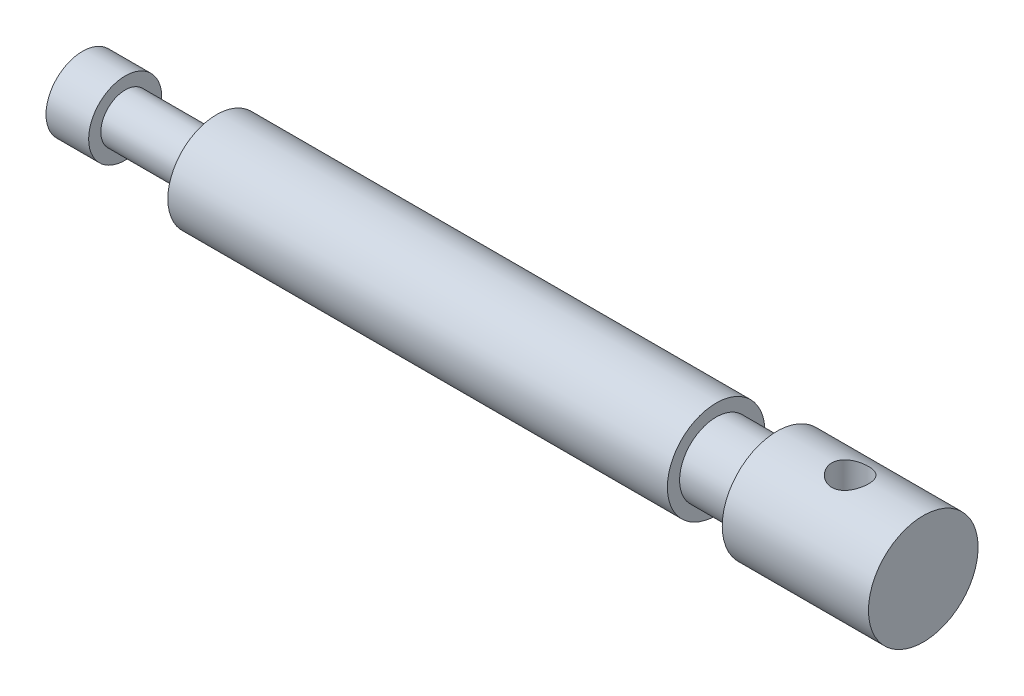
ISO-10303-21;
HEADER;
FILE_DESCRIPTION(('STEP AP214'),'2;1');
FILE_NAME('part.step','',(''),(''),'','','');
FILE_SCHEMA(('AUTOMOTIVE_DESIGN { 1 0 10303 214 1 1 1 1 }'));
ENDSEC;
DATA;
#1=APPLICATION_CONTEXT('core data for automotive mechanical design processes');
#2=APPLICATION_PROTOCOL_DEFINITION('international standard','automotive_design',2000,#1);
#3=PRODUCT_CONTEXT('',#1,'mechanical');
#4=PRODUCT('Part','Part','',(#3));
#5=PRODUCT_RELATED_PRODUCT_CATEGORY('part','',(#4));
#6=PRODUCT_DEFINITION_FORMATION('','',#4);
#7=PRODUCT_DEFINITION_CONTEXT('part definition',#1,'design');
#8=PRODUCT_DEFINITION('design','',#6,#7);
#9=PRODUCT_DEFINITION_SHAPE('','',#8);
#10=(LENGTH_UNIT() NAMED_UNIT(*) SI_UNIT(.MILLI.,.METRE.));
#11=(NAMED_UNIT(*) PLANE_ANGLE_UNIT() SI_UNIT($,.RADIAN.));
#12=(NAMED_UNIT(*) SI_UNIT($,.STERADIAN.) SOLID_ANGLE_UNIT());
#13=UNCERTAINTY_MEASURE_WITH_UNIT(LENGTH_MEASURE(1.E-05),#10,'distance_accuracy_value','');
#14=(GEOMETRIC_REPRESENTATION_CONTEXT(3) GLOBAL_UNCERTAINTY_ASSIGNED_CONTEXT((#13)) GLOBAL_UNIT_ASSIGNED_CONTEXT((#10,
#11,#12)) REPRESENTATION_CONTEXT('',''));
#15=CARTESIAN_POINT('',(0.,0.,0.));
#16=DIRECTION('',(0.,0.,1.));
#17=DIRECTION('',(1.,0.,0.));
#18=AXIS2_PLACEMENT_3D('',#15,#16,#17);
#19=CARTESIAN_POINT('',(0.,0.,0.));
#20=DIRECTION('',(-1.,0.,0.));
#21=DIRECTION('',(0.,0.,1.));
#22=AXIS2_PLACEMENT_3D('',#19,#20,#21);
#23=CYLINDRICAL_SURFACE('',#22,9.);
#24=CARTESIAN_POINT('',(126.,-8.48528137423857,-2.99999999999999));
#25=CARTESIAN_POINT('',(125.836595475492,-8.48528083591302,-3.00000077384313));
#26=CARTESIAN_POINT('',(125.673195600529,-8.49005307872572,-2.98660435105656));
#27=CARTESIAN_POINT('',(125.351236737017,-8.50852722243765,-2.93355339506642));
#28=CARTESIAN_POINT('',(125.192678550383,-8.52223059426566,-2.89389453650519));
#29=CARTESIAN_POINT('',(124.885119321008,-8.55684611066375,-2.78986645705471));
#30=CARTESIAN_POINT('',(124.736100211672,-8.57774411913966,-2.72554566420974));
#31=CARTESIAN_POINT('',(124.450919854356,-8.62437366030974,-2.57418488532414));
#32=CARTESIAN_POINT('',(124.314761452339,-8.65010625910837,-2.48713988658055));
#33=CARTESIAN_POINT('',(124.053840112985,-8.70463468222419,-2.28915343932863));
#34=CARTESIAN_POINT('',(123.929653713985,-8.73350684533932,-2.17747302413376));
#35=CARTESIAN_POINT('',(123.701379596326,-8.79041594403009,-1.93496300164319));
#36=CARTESIAN_POINT('',(123.597295105253,-8.81845274486885,-1.80413032515714));
#37=CARTESIAN_POINT('',(123.409563308011,-8.87141600765396,-1.52281352389504));
#38=CARTESIAN_POINT('',(123.326520088146,-8.89624223104816,-1.37190573367359));
#39=CARTESIAN_POINT('',(123.187225244617,-8.93908760312949,-1.05729366896244));
#40=CARTESIAN_POINT('',(123.130966400469,-8.95710858609006,-0.893592857061653));
#41=CARTESIAN_POINT('',(123.048792436103,-8.9837722629572,-0.564086452300499));
#42=CARTESIAN_POINT('',(123.021889661229,-8.99271944332677,-0.398552264558921));
#43=CARTESIAN_POINT('',(122.996051119918,-9.00130824654744,-0.0650936244722837));
#44=CARTESIAN_POINT('',(122.997108145043,-9.00095226788686,0.102830200631674));
#45=CARTESIAN_POINT('',(123.026532763698,-8.99118118856194,0.42931054558143));
#46=CARTESIAN_POINT('',(123.053827585423,-8.98212194265352,0.587976145774955));
#47=CARTESIAN_POINT('',(123.133178942941,-8.95640902019195,0.8983303164665));
#48=CARTESIAN_POINT('',(123.185237156939,-8.93975482893545,1.05001841333763));
#49=CARTESIAN_POINT('',(123.313263951918,-8.90027010879673,1.3444574245259));
#50=CARTESIAN_POINT('',(123.38953781564,-8.87736127572047,1.48706466290652));
#51=CARTESIAN_POINT('',(123.563579116346,-8.82775179116758,1.75777297658195));
#52=CARTESIAN_POINT('',(123.661352529983,-8.80105008604401,1.88587000315601));
#53=CARTESIAN_POINT('',(123.881023180379,-8.7451857554969,2.13030259965391));
#54=CARTESIAN_POINT('',(124.003839473524,-8.71596645506633,2.2458004711958));
#55=CARTESIAN_POINT('',(124.26734617718,-8.65942005746702,2.45483177879451));
#56=CARTESIAN_POINT('',(124.408039337184,-8.63209325236847,2.54836182984462));
#57=CARTESIAN_POINT('',(124.70596087681,-8.58211575363337,2.71196236510722));
#58=CARTESIAN_POINT('',(124.863396393953,-8.55953727854244,2.78167939086401));
#59=CARTESIAN_POINT('',(125.188714182643,-8.52244952473155,2.893329579808));
#60=CARTESIAN_POINT('',(125.356592043619,-8.50793686461278,2.93527438724248));
#61=CARTESIAN_POINT('',(125.689915066235,-8.48938908946755,2.98848384629256));
#62=CARTESIAN_POINT('',(125.855128274246,-8.48491080956268,3.00104728652289));
#63=CARTESIAN_POINT('',(126.185328447342,-8.48570016177553,2.99881631672915));
#64=CARTESIAN_POINT('',(126.350315448072,-8.49096602375444,2.98402687568028));
#65=CARTESIAN_POINT('',(126.669470897136,-8.51020854270898,2.92867695465693));
#66=CARTESIAN_POINT('',(126.823816290452,-8.52387976322521,2.88901918194205));
#67=CARTESIAN_POINT('',(127.123630818718,-8.55805661013069,2.7861415876814));
#68=CARTESIAN_POINT('',(127.269098374772,-8.57856344804518,2.72291758909027));
#69=CARTESIAN_POINT('',(127.552141262541,-8.6249063278736,2.57242302221682));
#70=CARTESIAN_POINT('',(127.689319927925,-8.65089076996884,2.48445335507551));
#71=CARTESIAN_POINT('',(127.947438157151,-8.70497306192896,2.28775689167269));
#72=CARTESIAN_POINT('',(128.068372915984,-8.73307153331383,2.17902397649636));
#73=CARTESIAN_POINT('',(128.296583952272,-8.78985115913547,1.93767511770099));
#74=CARTESIAN_POINT('',(128.402923170057,-8.81849530733689,1.80416181163997));
#75=CARTESIAN_POINT('',(128.591748427044,-8.87180554839326,1.52048187420078));
#76=CARTESIAN_POINT('',(128.674235313487,-8.89647178253084,1.37031583459367));
#77=CARTESIAN_POINT('',(128.812260314585,-8.93893217431809,1.0583395872969));
#78=CARTESIAN_POINT('',(128.867973831444,-8.95677090013593,0.896613369963606));
#79=CARTESIAN_POINT('',(128.95118322618,-8.98375832513324,0.565375397538069));
#80=CARTESIAN_POINT('',(128.978689289642,-8.99291016102056,0.395866475861687));
#81=CARTESIAN_POINT('',(129.003786232817,-9.00125589708769,0.0624460075801409));
#82=CARTESIAN_POINT('',(129.002722361797,-9.00089760268318,-0.101354171760038));
#83=CARTESIAN_POINT('',(128.974028075561,-8.99136589558194,-0.426333435000507));
#84=CARTESIAN_POINT('',(128.946399815542,-8.98219319800727,-0.587512730457158));
#85=CARTESIAN_POINT('',(128.866253296272,-8.95622744863237,-0.900126358296163));
#86=CARTESIAN_POINT('',(128.814137353941,-8.93955775083446,-1.05167481273835));
#87=CARTESIAN_POINT('',(128.686867406709,-8.90031482113486,-1.34393505281937));
#88=CARTESIAN_POINT('',(128.611709234409,-8.8777405214405,-1.48464487242728));
#89=CARTESIAN_POINT('',(128.437291463694,-8.82797606483643,-1.75690204892635));
#90=CARTESIAN_POINT('',(128.337243943855,-8.8006461747578,-1.88791875467282));
#91=CARTESIAN_POINT('',(128.117227826531,-8.74478966375639,-2.13174307881727));
#92=CARTESIAN_POINT('',(127.997252873212,-8.71626266319292,-2.24454486487376));
#93=CARTESIAN_POINT('',(127.735171933239,-8.65989839476795,-2.45322542649934));
#94=CARTESIAN_POINT('',(127.59238346707,-8.63213183965892,-2.54826889799369));
#95=CARTESIAN_POINT('',(127.291996719292,-8.58180579969046,-2.71294302990334));
#96=CARTESIAN_POINT('',(127.134402320911,-8.55924495483748,-2.78258033045842));
#97=CARTESIAN_POINT('',(126.816114527953,-8.52304002619544,-2.89153148461249));
#98=CARTESIAN_POINT('',(126.655883209424,-8.50903898571547,-2.93207372744855));
#99=CARTESIAN_POINT('',(126.3304318486,-8.49016150618555,-2.9863029604478));
#100=CARTESIAN_POINT('',(126.165213547768,-8.48528191852384,-2.99999921758977));
#101=CARTESIAN_POINT('',(126.,-8.48528137423857,-2.99999999999999));
#102=B_SPLINE_CURVE_WITH_KNOTS('',3,(#24,#25,#26,#27,#28,#29,#30,#31,#32,#33,#34,#35,#36,#37,
#38,#39,#40,#41,#42,#43,#44,#45,#46,#47,#48,#49,#50,#51,#52,#53,#54,#55,#56,#57,#58,#59,#60,#61,
#62,#63,#64,#65,#66,#67,#68,#69,#70,#71,#72,#73,#74,#75,#76,#77,#78,#79,#80,#81,#82,#83,#84,#85,
#86,#87,#88,#89,#90,#91,#92,#93,#94,#95,#96,#97,#98,#99,#100,#101),.UNSPECIFIED.,.T.,.F.,(4,2,2,
2,2,2,2,2,2,2,2,2,2,2,2,2,2,2,2,2,2,2,2,2,2,2,2,2,2,2,2,2,2,2,2,2,2,2,4),(0.,0.489601754398035,
0.979284165045477,1.46800988250247,1.95684349855631,2.46304012282703,2.96931795515961,
3.48880518430968,4.00815229160365,4.509429562948,5.01057759906979,5.49207014476705,
5.97359532567707,6.46144964581001,6.94943975622063,7.46040523091749,7.97144938836314,
8.48977919529162,9.00789154069845,9.50262874093315,9.99727607511698,10.4749318730632,
10.9526723744083,11.4455657320714,11.9386045698638,12.4553642451328,12.9721055627259,
13.4854137357255,13.9985364901247,14.487542540329,14.9765089202934,15.4577086812129,
15.9389955228972,16.438065585619,16.9372951329789,17.4560670820843,17.974703348006,
18.4698963648807,18.9649184157139),.UNSPECIFIED.);
#103=CARTESIAN_POINT('',(126.,-8.48528137423857,-2.99999999999999));
#104=VERTEX_POINT('',#103);
#105=EDGE_CURVE('E64',#104,#104,#102,.T.);
#106=ORIENTED_EDGE('',*,*,#105,.T.);
#107=EDGE_LOOP('',(#106));
#108=FACE_BOUND('',#107,.T.);
#109=CARTESIAN_POINT('',(138.,0.,0.));
#110=DIRECTION('',(-1.,0.,0.));
#111=DIRECTION('',(0.,0.,1.));
#112=AXIS2_PLACEMENT_3D('',#109,#110,#111);
#113=CIRCLE('',#112,9.);
#114=CARTESIAN_POINT('',(138.,0.,9.));
#115=VERTEX_POINT('',#114);
#116=EDGE_CURVE('E10',#115,#115,#113,.T.);
#117=ORIENTED_EDGE('',*,*,#116,.T.);
#118=EDGE_LOOP('',(#117));
#119=FACE_BOUND('',#118,.T.);
#120=CARTESIAN_POINT('',(114.,0.,0.));
#121=DIRECTION('',(-1.,0.,0.));
#122=DIRECTION('',(0.,0.,1.));
#123=AXIS2_PLACEMENT_3D('',#120,#121,#122);
#124=CIRCLE('',#123,9.);
#125=CARTESIAN_POINT('',(114.,0.,9.));
#126=VERTEX_POINT('',#125);
#127=EDGE_CURVE('E55',#126,#126,#124,.T.);
#128=ORIENTED_EDGE('',*,*,#127,.F.);
#129=EDGE_LOOP('',(#128));
#130=FACE_BOUND('',#129,.T.);
#131=CARTESIAN_POINT('',(126.,8.48528137423857,-2.99999999999999));
#132=CARTESIAN_POINT('',(126.163404524508,8.48528083591302,-3.00000077384313));
#133=CARTESIAN_POINT('',(126.326804399471,8.49005307872572,-2.98660435105656));
#134=CARTESIAN_POINT('',(126.648763262983,8.50852722243765,-2.93355339506642));
#135=CARTESIAN_POINT('',(126.807321449617,8.52223059426566,-2.89389453650519));
#136=CARTESIAN_POINT('',(127.114880678992,8.55684611066375,-2.78986645705471));
#137=CARTESIAN_POINT('',(127.263899788328,8.57774411913966,-2.72554566420974));
#138=CARTESIAN_POINT('',(127.549080145644,8.62437366030974,-2.57418488532414));
#139=CARTESIAN_POINT('',(127.685238547661,8.65010625910837,-2.48713988658055));
#140=CARTESIAN_POINT('',(127.946159887015,8.70463468222419,-2.28915343932863));
#141=CARTESIAN_POINT('',(128.070346286015,8.73350684533932,-2.17747302413376));
#142=CARTESIAN_POINT('',(128.298620403674,8.79041594403009,-1.93496300164319));
#143=CARTESIAN_POINT('',(128.402704894747,8.81845274486885,-1.80413032515713));
#144=CARTESIAN_POINT('',(128.590436691989,8.87141600765397,-1.52281352389503));
#145=CARTESIAN_POINT('',(128.673479911854,8.89624223104817,-1.37190573367358));
#146=CARTESIAN_POINT('',(128.812774755383,8.93908760312949,-1.05729366896243));
#147=CARTESIAN_POINT('',(128.869033599531,8.95710858609006,-0.893592857061646));
#148=CARTESIAN_POINT('',(128.951207563897,8.9837722629572,-0.564086452300496));
#149=CARTESIAN_POINT('',(128.978110338771,8.99271944332677,-0.398552264558917));
#150=CARTESIAN_POINT('',(129.003948880082,9.00130824654744,-0.0650936244722798));
#151=CARTESIAN_POINT('',(129.002891854957,9.00095226788686,0.102830200631678));
#152=CARTESIAN_POINT('',(128.973467236302,8.99118118856194,0.429310545581434));
#153=CARTESIAN_POINT('',(128.946172414577,8.98212194265352,0.587976145774959));
#154=CARTESIAN_POINT('',(128.866821057059,8.95640902019195,0.898330316466505));
#155=CARTESIAN_POINT('',(128.814762843061,8.93975482893545,1.05001841333764));
#156=CARTESIAN_POINT('',(128.686736048082,8.90027010879673,1.3444574245259));
#157=CARTESIAN_POINT('',(128.61046218436,8.87736127572047,1.48706466290652));
#158=CARTESIAN_POINT('',(128.436420883654,8.82775179116758,1.75777297658195));
#159=CARTESIAN_POINT('',(128.338647470017,8.80105008604401,1.88587000315601));
#160=CARTESIAN_POINT('',(128.118976819621,8.7451857554969,2.13030259965391));
#161=CARTESIAN_POINT('',(127.996160526476,8.71596645506633,2.24580047119581));
#162=CARTESIAN_POINT('',(127.73265382282,8.65942005746702,2.45483177879452));
#163=CARTESIAN_POINT('',(127.591960662816,8.63209325236846,2.54836182984462));
#164=CARTESIAN_POINT('',(127.29403912319,8.58211575363337,2.71196236510722));
#165=CARTESIAN_POINT('',(127.136603606047,8.55953727854244,2.78167939086401));
#166=CARTESIAN_POINT('',(126.811285817357,8.52244952473155,2.893329579808));
#167=CARTESIAN_POINT('',(126.643407956381,8.50793686461278,2.93527438724248));
#168=CARTESIAN_POINT('',(126.310084933765,8.48938908946755,2.98848384629256));
#169=CARTESIAN_POINT('',(126.144871725754,8.48491080956268,3.00104728652289));
#170=CARTESIAN_POINT('',(125.814671552658,8.48570016177553,2.99881631672915));
#171=CARTESIAN_POINT('',(125.649684551928,8.49096602375444,2.98402687568029));
#172=CARTESIAN_POINT('',(125.330529102864,8.51020854270898,2.92867695465693));
#173=CARTESIAN_POINT('',(125.176183709548,8.52387976322521,2.88901918194205));
#174=CARTESIAN_POINT('',(124.876369181282,8.55805661013069,2.7861415876814));
#175=CARTESIAN_POINT('',(124.730901625228,8.57856344804518,2.72291758909027));
#176=CARTESIAN_POINT('',(124.447858737459,8.62490632787361,2.57242302221681));
#177=CARTESIAN_POINT('',(124.310680072075,8.65089076996885,2.48445335507549));
#178=CARTESIAN_POINT('',(124.052561842849,8.70497306192896,2.28775689167267));
#179=CARTESIAN_POINT('',(123.931627084016,8.73307153331383,2.17902397649635));
#180=CARTESIAN_POINT('',(123.703416047728,8.78985115913547,1.93767511770099));
#181=CARTESIAN_POINT('',(123.597076829943,8.81849530733689,1.80416181163997));
#182=CARTESIAN_POINT('',(123.408251572956,8.87180554839326,1.52048187420079));
#183=CARTESIAN_POINT('',(123.325764686513,8.89647178253084,1.37031583459367));
#184=CARTESIAN_POINT('',(123.187739685415,8.93893217431809,1.0583395872969));
#185=CARTESIAN_POINT('',(123.132026168556,8.95677090013593,0.896613369963602));
#186=CARTESIAN_POINT('',(123.04881677382,8.98375832513324,0.565375397538062));
#187=CARTESIAN_POINT('',(123.021310710359,8.99291016102056,0.395866475861682));
#188=CARTESIAN_POINT('',(122.996213767183,9.00125589708769,0.0624460075801372));
#189=CARTESIAN_POINT('',(122.997277638203,9.00089760268318,-0.101354171760041));
#190=CARTESIAN_POINT('',(123.025971924439,8.99136589558194,-0.426333435000507));
#191=CARTESIAN_POINT('',(123.053600184458,8.98219319800727,-0.587512730457156));
#192=CARTESIAN_POINT('',(123.133746703728,8.95622744863237,-0.900126358296162));
#193=CARTESIAN_POINT('',(123.185862646059,8.93955775083446,-1.05167481273835));
#194=CARTESIAN_POINT('',(123.313132593291,8.90031482113485,-1.34393505281937));
#195=CARTESIAN_POINT('',(123.388290765591,8.8777405214405,-1.48464487242728));
#196=CARTESIAN_POINT('',(123.562708536306,8.82797606483643,-1.75690204892634));
#197=CARTESIAN_POINT('',(123.662756056145,8.8006461747578,-1.88791875467281));
#198=CARTESIAN_POINT('',(123.882772173469,8.74478966375639,-2.13174307881726));
#199=CARTESIAN_POINT('',(124.002747126788,8.71626266319292,-2.24454486487376));
#200=CARTESIAN_POINT('',(124.264828066761,8.65989839476795,-2.45322542649934));
#201=CARTESIAN_POINT('',(124.40761653293,8.63213183965892,-2.54826889799369));
#202=CARTESIAN_POINT('',(124.708003280708,8.58180579969046,-2.71294302990333));
#203=CARTESIAN_POINT('',(124.865597679089,8.55924495483748,-2.78258033045841));
#204=CARTESIAN_POINT('',(125.183885472047,8.52304002619544,-2.89153148461249));
#205=CARTESIAN_POINT('',(125.344116790576,8.50903898571547,-2.93207372744855));
#206=CARTESIAN_POINT('',(125.6695681514,8.49016150618555,-2.9863029604478));
#207=CARTESIAN_POINT('',(125.834786452232,8.48528191852384,-2.99999921758977));
#208=CARTESIAN_POINT('',(126.,8.48528137423857,-2.99999999999999));
#209=B_SPLINE_CURVE_WITH_KNOTS('',3,(#131,#132,#133,#134,#135,#136,#137,#138,#139,#140,#141,
#142,#143,#144,#145,#146,#147,#148,#149,#150,#151,#152,#153,#154,#155,#156,#157,#158,#159,#160,
#161,#162,#163,#164,#165,#166,#167,#168,#169,#170,#171,#172,#173,#174,#175,#176,#177,#178,#179,
#180,#181,#182,#183,#184,#185,#186,#187,#188,#189,#190,#191,#192,#193,#194,#195,#196,#197,#198,
#199,#200,#201,#202,#203,#204,#205,#206,#207,#208),.UNSPECIFIED.,.T.,.F.,(4,2,2,2,2,2,2,2,2,2,2,
2,2,2,2,2,2,2,2,2,2,2,2,2,2,2,2,2,2,2,2,2,2,2,2,2,2,2,4),(0.,0.489601754398035,
0.979284165045477,1.46800988250248,1.9568434985563,2.46304012282703,2.96931795515962,
3.4888051843097,4.00815229160365,4.50942956294801,5.0105775990698,5.49207014476705,
5.97359532567707,6.46144964581002,6.94943975622063,7.4604052309175,7.97144938836315,
8.48977919529163,9.00789154069846,9.50262874093315,9.99727607511699,10.4749318730632,
10.9526723744083,11.4455657320714,11.9386045698638,12.4553642451327,12.9721055627259,
13.4854137357255,13.9985364901247,14.487542540329,14.9765089202934,15.4577086812128,
15.9389955228972,16.438065585619,16.9372951329789,17.4560670820843,17.974703348006,
18.4698963648807,18.9649184157139),.UNSPECIFIED.);
#210=CARTESIAN_POINT('',(126.,8.48528137423857,-2.99999999999999));
#211=VERTEX_POINT('',#210);
#212=EDGE_CURVE('E46',#211,#211,#209,.T.);
#213=ORIENTED_EDGE('',*,*,#212,.T.);
#214=EDGE_LOOP('',(#213));
#215=FACE_BOUND('',#214,.T.);
#216=ADVANCED_FACE('F42',(#108,#119,#130,#215),#23,.T.);
#217=CARTESIAN_POINT('',(138.,0.,0.));
#218=DIRECTION('',(-1.,0.,0.));
#219=DIRECTION('',(0.,0.,1.));
#220=AXIS2_PLACEMENT_3D('',#217,#218,#219);
#221=PLANE('',#220);
#222=ORIENTED_EDGE('',*,*,#116,.F.);
#223=EDGE_LOOP('',(#222));
#224=FACE_BOUND('',#223,.T.);
#225=ADVANCED_FACE('F44',(#224),#221,.F.);
#226=CARTESIAN_POINT('',(114.,0.,0.));
#227=DIRECTION('',(-1.,0.,0.));
#228=DIRECTION('',(0.,0.,1.));
#229=AXIS2_PLACEMENT_3D('',#226,#227,#228);
#230=PLANE('',#229);
#231=ORIENTED_EDGE('',*,*,#127,.T.);
#232=EDGE_LOOP('',(#231));
#233=FACE_BOUND('',#232,.T.);
#234=CARTESIAN_POINT('',(114.,0.,0.));
#235=DIRECTION('',(-1.,0.,0.));
#236=DIRECTION('',(0.,0.,1.));
#237=AXIS2_PLACEMENT_3D('',#234,#235,#236);
#238=CIRCLE('',#237,6.);
#239=CARTESIAN_POINT('',(114.,0.,6.));
#240=VERTEX_POINT('',#239);
#241=EDGE_CURVE('E61',#240,#240,#238,.T.);
#242=ORIENTED_EDGE('',*,*,#241,.F.);
#243=EDGE_LOOP('',(#242));
#244=FACE_BOUND('',#243,.T.);
#245=ADVANCED_FACE('F108',(#233,#244),#230,.T.);
#246=CARTESIAN_POINT('',(0.,0.,0.));
#247=DIRECTION('',(-1.,0.,0.));
#248=DIRECTION('',(0.,0.,1.));
#249=AXIS2_PLACEMENT_3D('',#246,#247,#248);
#250=CYLINDRICAL_SURFACE('',#249,6.);
#251=ORIENTED_EDGE('',*,*,#241,.T.);
#252=EDGE_LOOP('',(#251));
#253=FACE_BOUND('',#252,.T.);
#254=CARTESIAN_POINT('',(104.,0.,0.));
#255=DIRECTION('',(-1.,0.,0.));
#256=DIRECTION('',(0.,0.,1.));
#257=AXIS2_PLACEMENT_3D('',#254,#255,#256);
#258=CIRCLE('',#257,6.);
#259=CARTESIAN_POINT('',(104.,0.,6.));
#260=VERTEX_POINT('',#259);
#261=EDGE_CURVE('E154',#260,#260,#258,.T.);
#262=ORIENTED_EDGE('',*,*,#261,.F.);
#263=EDGE_LOOP('',(#262));
#264=FACE_BOUND('',#263,.T.);
#265=ADVANCED_FACE('F105',(#253,#264),#250,.T.);
#266=CARTESIAN_POINT('',(104.,0.,0.));
#267=DIRECTION('',(-1.,0.,0.));
#268=DIRECTION('',(0.,0.,1.));
#269=AXIS2_PLACEMENT_3D('',#266,#267,#268);
#270=PLANE('',#269);
#271=CARTESIAN_POINT('',(104.,0.,0.));
#272=DIRECTION('',(-1.,0.,0.));
#273=DIRECTION('',(0.,0.,1.));
#274=AXIS2_PLACEMENT_3D('',#271,#272,#273);
#275=CIRCLE('',#274,8.);
#276=CARTESIAN_POINT('',(104.,0.,8.));
#277=VERTEX_POINT('',#276);
#278=EDGE_CURVE('E150',#277,#277,#275,.T.);
#279=ORIENTED_EDGE('',*,*,#278,.F.);
#280=EDGE_LOOP('',(#279));
#281=FACE_BOUND('',#280,.T.);
#282=ORIENTED_EDGE('',*,*,#261,.T.);
#283=EDGE_LOOP('',(#282));
#284=FACE_BOUND('',#283,.T.);
#285=ADVANCED_FACE('F101',(#281,#284),#270,.F.);
#286=CARTESIAN_POINT('',(0.,0.,0.));
#287=DIRECTION('',(-1.,0.,0.));
#288=DIRECTION('',(0.,0.,1.));
#289=AXIS2_PLACEMENT_3D('',#286,#287,#288);
#290=CYLINDRICAL_SURFACE('',#289,8.);
#291=ORIENTED_EDGE('',*,*,#278,.T.);
#292=EDGE_LOOP('',(#291));
#293=FACE_BOUND('',#292,.T.);
#294=CARTESIAN_POINT('',(22.,0.,0.));
#295=DIRECTION('',(-1.,0.,0.));
#296=DIRECTION('',(0.,0.,1.));
#297=AXIS2_PLACEMENT_3D('',#294,#295,#296);
#298=CIRCLE('',#297,8.);
#299=CARTESIAN_POINT('',(22.,0.,8.));
#300=VERTEX_POINT('',#299);
#301=EDGE_CURVE('E146',#300,#300,#298,.T.);
#302=ORIENTED_EDGE('',*,*,#301,.F.);
#303=EDGE_LOOP('',(#302));
#304=FACE_BOUND('',#303,.T.);
#305=ADVANCED_FACE('F97',(#293,#304),#290,.T.);
#306=CARTESIAN_POINT('',(22.,0.,0.));
#307=DIRECTION('',(-1.,0.,0.));
#308=DIRECTION('',(0.,0.,1.));
#309=AXIS2_PLACEMENT_3D('',#306,#307,#308);
#310=PLANE('',#309);
#311=ORIENTED_EDGE('',*,*,#301,.T.);
#312=EDGE_LOOP('',(#311));
#313=FACE_BOUND('',#312,.T.);
#314=CARTESIAN_POINT('',(22.,0.,0.));
#315=DIRECTION('',(-1.,0.,0.));
#316=DIRECTION('',(0.,0.,1.));
#317=AXIS2_PLACEMENT_3D('',#314,#315,#316);
#318=CIRCLE('',#317,4.);
#319=CARTESIAN_POINT('',(22.,0.,4.));
#320=VERTEX_POINT('',#319);
#321=EDGE_CURVE('E142',#320,#320,#318,.T.);
#322=ORIENTED_EDGE('',*,*,#321,.F.);
#323=EDGE_LOOP('',(#322));
#324=FACE_BOUND('',#323,.T.);
#325=ADVANCED_FACE('F93',(#313,#324),#310,.T.);
#326=CARTESIAN_POINT('',(0.,0.,0.));
#327=DIRECTION('',(-1.,0.,0.));
#328=DIRECTION('',(0.,0.,1.));
#329=AXIS2_PLACEMENT_3D('',#326,#327,#328);
#330=CYLINDRICAL_SURFACE('',#329,4.);
#331=ORIENTED_EDGE('',*,*,#321,.T.);
#332=EDGE_LOOP('',(#331));
#333=FACE_BOUND('',#332,.T.);
#334=CARTESIAN_POINT('',(7.,0.,0.));
#335=DIRECTION('',(-1.,0.,0.));
#336=DIRECTION('',(0.,0.,1.));
#337=AXIS2_PLACEMENT_3D('',#334,#335,#336);
#338=CIRCLE('',#337,4.);
#339=CARTESIAN_POINT('',(7.,0.,4.));
#340=VERTEX_POINT('',#339);
#341=EDGE_CURVE('E136',#340,#340,#338,.T.);
#342=ORIENTED_EDGE('',*,*,#341,.F.);
#343=EDGE_LOOP('',(#342));
#344=FACE_BOUND('',#343,.T.);
#345=ADVANCED_FACE('F89',(#333,#344),#330,.T.);
#346=CARTESIAN_POINT('',(7.,0.,0.));
#347=DIRECTION('',(-1.,0.,0.));
#348=DIRECTION('',(0.,0.,1.));
#349=AXIS2_PLACEMENT_3D('',#346,#347,#348);
#350=PLANE('',#349);
#351=CARTESIAN_POINT('',(7.,0.,0.));
#352=DIRECTION('',(-1.,0.,0.));
#353=DIRECTION('',(0.,0.,1.));
#354=AXIS2_PLACEMENT_3D('',#351,#352,#353);
#355=CIRCLE('',#354,6.);
#356=CARTESIAN_POINT('',(7.,0.,6.));
#357=VERTEX_POINT('',#356);
#358=EDGE_CURVE('E131',#357,#357,#355,.T.);
#359=ORIENTED_EDGE('',*,*,#358,.F.);
#360=EDGE_LOOP('',(#359));
#361=FACE_BOUND('',#360,.T.);
#362=ORIENTED_EDGE('',*,*,#341,.T.);
#363=EDGE_LOOP('',(#362));
#364=FACE_BOUND('',#363,.T.);
#365=ADVANCED_FACE('F85',(#361,#364),#350,.F.);
#366=CARTESIAN_POINT('',(0.,0.,0.));
#367=DIRECTION('',(-1.,0.,0.));
#368=DIRECTION('',(0.,0.,1.));
#369=AXIS2_PLACEMENT_3D('',#366,#367,#368);
#370=CYLINDRICAL_SURFACE('',#369,6.);
#371=ORIENTED_EDGE('',*,*,#358,.T.);
#372=EDGE_LOOP('',(#371));
#373=FACE_BOUND('',#372,.T.);
#374=CARTESIAN_POINT('',(0.,0.,0.));
#375=DIRECTION('',(-1.,0.,0.));
#376=DIRECTION('',(0.,0.,1.));
#377=AXIS2_PLACEMENT_3D('',#374,#375,#376);
#378=CIRCLE('',#377,6.);
#379=CARTESIAN_POINT('',(0.,0.,6.));
#380=VERTEX_POINT('',#379);
#381=EDGE_CURVE('E128',#380,#380,#378,.T.);
#382=ORIENTED_EDGE('',*,*,#381,.F.);
#383=EDGE_LOOP('',(#382));
#384=FACE_BOUND('',#383,.T.);
#385=ADVANCED_FACE('F81',(#373,#384),#370,.T.);
#386=CARTESIAN_POINT('',(0.,0.,0.));
#387=DIRECTION('',(-1.,0.,0.));
#388=DIRECTION('',(0.,0.,1.));
#389=AXIS2_PLACEMENT_3D('',#386,#387,#388);
#390=PLANE('',#389);
#391=ORIENTED_EDGE('',*,*,#381,.T.);
#392=EDGE_LOOP('',(#391));
#393=FACE_BOUND('',#392,.T.);
#394=ADVANCED_FACE('F76',(#393),#390,.T.);
#395=CARTESIAN_POINT('',(126.,10.,0.));
#396=DIRECTION('',(0.,-1.,0.));
#397=DIRECTION('',(0.,0.,-1.));
#398=AXIS2_PLACEMENT_3D('',#395,#396,#397);
#399=CYLINDRICAL_SURFACE('',#398,2.99999999999999);
#400=ORIENTED_EDGE('',*,*,#212,.F.);
#401=EDGE_LOOP('',(#400));
#402=FACE_BOUND('',#401,.T.);
#403=ORIENTED_EDGE('',*,*,#105,.F.);
#404=EDGE_LOOP('',(#403));
#405=FACE_BOUND('',#404,.T.);
#406=ADVANCED_FACE('F72',(#402,#405),#399,.F.);
#407=CLOSED_SHELL('',(#216,#225,#245,#265,#285,#305,#325,#345,#365,#385,#394,#406));
#408=MANIFOLD_SOLID_BREP('B2',#407);
#409=ADVANCED_BREP_SHAPE_REPRESENTATION('',(#18,#408),#14);
#410=SHAPE_DEFINITION_REPRESENTATION(#9,#409);
ENDSEC;
END-ISO-10303-21;
